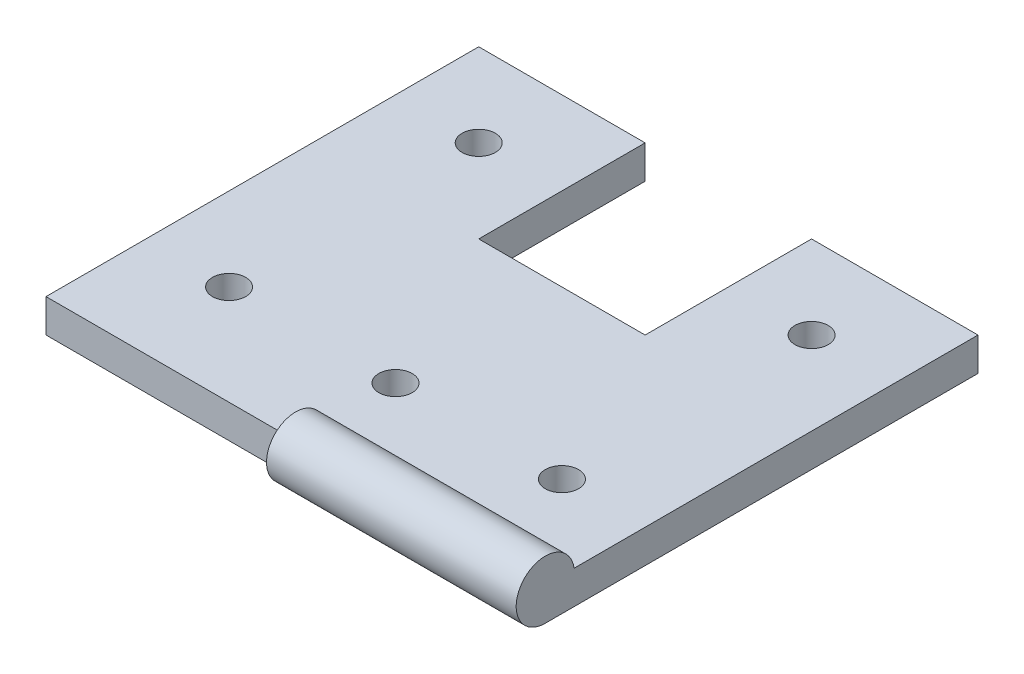
ISO-10303-21;
HEADER;
FILE_DESCRIPTION(('STEP AP214'),'2;1');
FILE_NAME('part.step','',(''),(''),'','','');
FILE_SCHEMA(('AUTOMOTIVE_DESIGN { 1 0 10303 214 1 1 1 1 }'));
ENDSEC;
DATA;
#1=APPLICATION_CONTEXT('core data for automotive mechanical design processes');
#2=APPLICATION_PROTOCOL_DEFINITION('international standard','automotive_design',2000,#1);
#3=PRODUCT_CONTEXT('',#1,'mechanical');
#4=PRODUCT('Part','Part','',(#3));
#5=PRODUCT_RELATED_PRODUCT_CATEGORY('part','',(#4));
#6=PRODUCT_DEFINITION_FORMATION('','',#4);
#7=PRODUCT_DEFINITION_CONTEXT('part definition',#1,'design');
#8=PRODUCT_DEFINITION('design','',#6,#7);
#9=PRODUCT_DEFINITION_SHAPE('','',#8);
#10=(LENGTH_UNIT() NAMED_UNIT(*) SI_UNIT(.MILLI.,.METRE.));
#11=(NAMED_UNIT(*) PLANE_ANGLE_UNIT() SI_UNIT($,.RADIAN.));
#12=(NAMED_UNIT(*) SI_UNIT($,.STERADIAN.) SOLID_ANGLE_UNIT());
#13=UNCERTAINTY_MEASURE_WITH_UNIT(LENGTH_MEASURE(1.E-05),#10,'distance_accuracy_value','');
#14=(GEOMETRIC_REPRESENTATION_CONTEXT(3) GLOBAL_UNCERTAINTY_ASSIGNED_CONTEXT((#13)) GLOBAL_UNIT_ASSIGNED_CONTEXT((#10,
#11,#12)) REPRESENTATION_CONTEXT('',''));
#15=CARTESIAN_POINT('',(0.,0.,0.));
#16=DIRECTION('',(0.,0.,1.));
#17=DIRECTION('',(1.,0.,0.));
#18=AXIS2_PLACEMENT_3D('',#15,#16,#17);
#19=CARTESIAN_POINT('',(18.0696318410112,1.,160.043414439873));
#20=DIRECTION('',(0.,0.,1.));
#21=DIRECTION('',(1.,0.,0.));
#22=AXIS2_PLACEMENT_3D('',#19,#20,#21);
#23=PLANE('',#22);
#24=DIRECTION('',(-1.,0.,0.));
#25=VECTOR('',#24,1.);
#26=CARTESIAN_POINT('',(18.0696318410112,1.,160.043414439873));
#27=LINE('',#26,#25);
#28=CARTESIAN_POINT('',(8.06963184101119,0.999999999999999,160.043414439873));
#29=VERTEX_POINT('',#28);
#30=CARTESIAN_POINT('',(3.06963184101119,1.,160.043414439873));
#31=VERTEX_POINT('',#30);
#32=EDGE_CURVE('E127',#29,#31,#27,.T.);
#33=ORIENTED_EDGE('',*,*,#32,.F.);
#34=DIRECTION('',(0.,-1.,0.));
#35=VECTOR('',#34,1.);
#36=CARTESIAN_POINT('',(8.06963184101119,10.,160.043414439873));
#37=LINE('',#36,#35);
#38=CARTESIAN_POINT('',(8.06963184101119,0.,160.043414439873));
#39=VERTEX_POINT('',#38);
#40=EDGE_CURVE('E111',#29,#39,#37,.T.);
#41=ORIENTED_EDGE('',*,*,#40,.T.);
#42=DIRECTION('',(-1.,0.,0.));
#43=VECTOR('',#42,1.);
#44=CARTESIAN_POINT('',(18.0696318410112,0.,160.043414439873));
#45=LINE('',#44,#43);
#46=CARTESIAN_POINT('',(3.06963184101119,0.,160.043414439873));
#47=VERTEX_POINT('',#46);
#48=EDGE_CURVE('E125',#39,#47,#45,.T.);
#49=ORIENTED_EDGE('',*,*,#48,.T.);
#50=DIRECTION('',(0.,-1.,0.));
#51=VECTOR('',#50,1.);
#52=CARTESIAN_POINT('',(3.06963184101119,1.,160.043414439873));
#53=LINE('',#52,#51);
#54=EDGE_CURVE('E41',#31,#47,#53,.T.);
#55=ORIENTED_EDGE('',*,*,#54,.F.);
#56=EDGE_LOOP('',(#33,#41,#49,#55));
#57=FACE_BOUND('',#56,.T.);
#58=ADVANCED_FACE('F33',(#57),#23,.F.);
#59=CARTESIAN_POINT('',(18.0696318410112,1.,173.043414439873));
#60=DIRECTION('',(0.,0.,-1.));
#61=DIRECTION('',(-1.,0.,0.));
#62=AXIS2_PLACEMENT_3D('',#59,#60,#61);
#63=PLANE('',#62);
#64=DIRECTION('',(0.,-1.,0.));
#65=VECTOR('',#64,1.);
#66=CARTESIAN_POINT('',(10.5696318410112,1.,173.043414439873));
#67=LINE('',#66,#65);
#68=CARTESIAN_POINT('',(10.5696318410112,1.,173.043414439873));
#69=VERTEX_POINT('',#68);
#70=CARTESIAN_POINT('',(10.5696318410112,0.,173.043414439873));
#71=VERTEX_POINT('',#70);
#72=EDGE_CURVE('E165',#69,#71,#67,.T.);
#73=ORIENTED_EDGE('',*,*,#72,.F.);
#74=DIRECTION('',(1.,0.,0.));
#75=VECTOR('',#74,1.);
#76=CARTESIAN_POINT('',(18.0696318410112,1.,173.043414439873));
#77=LINE('',#76,#75);
#78=CARTESIAN_POINT('',(3.06963184101119,1.,173.043414439873));
#79=VERTEX_POINT('',#78);
#80=EDGE_CURVE('E151',#79,#69,#77,.T.);
#81=ORIENTED_EDGE('',*,*,#80,.F.);
#82=DIRECTION('',(0.,-1.,0.));
#83=VECTOR('',#82,1.);
#84=CARTESIAN_POINT('',(3.06963184101119,1.,173.043414439873));
#85=LINE('',#84,#83);
#86=CARTESIAN_POINT('',(3.06963184101119,0.,173.043414439873));
#87=VERTEX_POINT('',#86);
#88=EDGE_CURVE('E149',#79,#87,#85,.T.);
#89=ORIENTED_EDGE('',*,*,#88,.T.);
#90=DIRECTION('',(1.,0.,0.));
#91=VECTOR('',#90,1.);
#92=CARTESIAN_POINT('',(18.0696318410112,0.,173.043414439873));
#93=LINE('',#92,#91);
#94=EDGE_CURVE('E145',#87,#71,#93,.T.);
#95=ORIENTED_EDGE('',*,*,#94,.T.);
#96=EDGE_LOOP('',(#73,#81,#89,#95));
#97=FACE_BOUND('',#96,.T.);
#98=ADVANCED_FACE('F253',(#97),#63,.F.);
#99=CARTESIAN_POINT('',(18.0696318410112,1.,160.043414439873));
#100=DIRECTION('',(-1.,0.,0.));
#101=DIRECTION('',(0.,0.,1.));
#102=AXIS2_PLACEMENT_3D('',#99,#100,#101);
#103=PLANE('',#102);
#104=DIRECTION('',(0.,0.,-1.));
#105=VECTOR('',#104,1.);
#106=CARTESIAN_POINT('',(18.0696318410112,1.,160.043414439873));
#107=LINE('',#106,#105);
#108=CARTESIAN_POINT('',(18.0696318410112,1.,172.177389036088));
#109=VERTEX_POINT('',#108);
#110=CARTESIAN_POINT('',(18.0696318410112,1.,160.043414439873));
#111=VERTEX_POINT('',#110);
#112=EDGE_CURVE('E148',#109,#111,#107,.T.);
#113=ORIENTED_EDGE('',*,*,#112,.F.);
#114=CARTESIAN_POINT('',(18.0696318410112,0.875,173.043414439873));
#115=DIRECTION('',(1.,0.,0.));
#116=DIRECTION('',(0.,0.,-1.));
#117=AXIS2_PLACEMENT_3D('',#114,#115,#116);
#118=CIRCLE('',#117,0.874999999999991);
#119=CARTESIAN_POINT('',(18.0696318410112,0.,173.043414439873));
#120=VERTEX_POINT('',#119);
#121=EDGE_CURVE('E170',#109,#120,#118,.T.);
#122=ORIENTED_EDGE('',*,*,#121,.T.);
#123=DIRECTION('',(0.,0.,-1.));
#124=VECTOR('',#123,1.);
#125=CARTESIAN_POINT('',(18.0696318410112,0.,160.043414439873));
#126=LINE('',#125,#124);
#127=CARTESIAN_POINT('',(18.0696318410112,0.,160.043414439873));
#128=VERTEX_POINT('',#127);
#129=EDGE_CURVE('E135',#120,#128,#126,.T.);
#130=ORIENTED_EDGE('',*,*,#129,.T.);
#131=DIRECTION('',(0.,-1.,0.));
#132=VECTOR('',#131,1.);
#133=CARTESIAN_POINT('',(18.0696318410112,1.,160.043414439873));
#134=LINE('',#133,#132);
#135=EDGE_CURVE('E11',#111,#128,#134,.T.);
#136=ORIENTED_EDGE('',*,*,#135,.F.);
#137=EDGE_LOOP('',(#113,#122,#130,#136));
#138=FACE_BOUND('',#137,.T.);
#139=ADVANCED_FACE('F35',(#138),#103,.F.);
#140=CARTESIAN_POINT('',(13.0696318410112,0.,160.043414439873));
#141=VERTEX_POINT('',#140);
#142=EDGE_CURVE('E134',#128,#141,#45,.T.);
#143=ORIENTED_EDGE('',*,*,#142,.T.);
#144=DIRECTION('',(0.,-1.,0.));
#145=VECTOR('',#144,1.);
#146=CARTESIAN_POINT('',(13.0696318410112,10.,160.043414439873));
#147=LINE('',#146,#145);
#148=CARTESIAN_POINT('',(13.0696318410112,0.999999999999999,160.043414439873));
#149=VERTEX_POINT('',#148);
#150=EDGE_CURVE('E48',#149,#141,#147,.T.);
#151=ORIENTED_EDGE('',*,*,#150,.F.);
#152=EDGE_CURVE('E158',#111,#149,#27,.T.);
#153=ORIENTED_EDGE('',*,*,#152,.F.);
#154=ORIENTED_EDGE('',*,*,#135,.T.);
#155=EDGE_LOOP('',(#143,#151,#153,#154));
#156=FACE_BOUND('',#155,.T.);
#157=ADVANCED_FACE('F240',(#156),#23,.F.);
#158=CARTESIAN_POINT('',(3.06963184101119,1.,160.043414439873));
#159=DIRECTION('',(1.,0.,0.));
#160=DIRECTION('',(0.,0.,-1.));
#161=AXIS2_PLACEMENT_3D('',#158,#159,#160);
#162=PLANE('',#161);
#163=DIRECTION('',(0.,0.,1.));
#164=VECTOR('',#163,1.);
#165=CARTESIAN_POINT('',(3.06963184101119,0.,160.043414439873));
#166=LINE('',#165,#164);
#167=EDGE_CURVE('E133',#47,#87,#166,.T.);
#168=ORIENTED_EDGE('',*,*,#167,.T.);
#169=ORIENTED_EDGE('',*,*,#88,.F.);
#170=DIRECTION('',(0.,0.,1.));
#171=VECTOR('',#170,1.);
#172=CARTESIAN_POINT('',(3.06963184101119,1.,160.043414439873));
#173=LINE('',#172,#171);
#174=EDGE_CURVE('E156',#31,#79,#173,.T.);
#175=ORIENTED_EDGE('',*,*,#174,.F.);
#176=ORIENTED_EDGE('',*,*,#54,.T.);
#177=EDGE_LOOP('',(#168,#169,#175,#176));
#178=FACE_BOUND('',#177,.T.);
#179=ADVANCED_FACE('F154',(#178),#162,.F.);
#180=CARTESIAN_POINT('',(0.,1.,0.));
#181=DIRECTION('',(0.,-1.,0.));
#182=DIRECTION('',(0.,0.,-1.));
#183=AXIS2_PLACEMENT_3D('',#180,#181,#182);
#184=PLANE('',#183);
#185=CARTESIAN_POINT('',(5.56963184101119,1.,162.543414439873));
#186=DIRECTION('',(0.,1.,0.));
#187=DIRECTION('',(0.,0.,1.));
#188=AXIS2_PLACEMENT_3D('',#185,#186,#187);
#189=CIRCLE('',#188,0.500000000000001);
#190=CARTESIAN_POINT('',(5.56963184101119,1.,163.043414439873));
#191=VERTEX_POINT('',#190);
#192=EDGE_CURVE('E195',#191,#191,#189,.T.);
#193=ORIENTED_EDGE('',*,*,#192,.F.);
#194=EDGE_LOOP('',(#193));
#195=FACE_BOUND('',#194,.T.);
#196=CARTESIAN_POINT('',(5.56963184101119,1.,170.043414439873));
#197=DIRECTION('',(0.,1.,0.));
#198=DIRECTION('',(0.,0.,1.));
#199=AXIS2_PLACEMENT_3D('',#196,#197,#198);
#200=CIRCLE('',#199,0.500000000000001);
#201=CARTESIAN_POINT('',(5.56963184101119,1.,170.543414439873));
#202=VERTEX_POINT('',#201);
#203=EDGE_CURVE('E201',#202,#202,#200,.T.);
#204=ORIENTED_EDGE('',*,*,#203,.F.);
#205=EDGE_LOOP('',(#204));
#206=FACE_BOUND('',#205,.T.);
#207=CARTESIAN_POINT('',(10.5696318410112,1.,170.043414439873));
#208=DIRECTION('',(0.,1.,0.));
#209=DIRECTION('',(0.,0.,1.));
#210=AXIS2_PLACEMENT_3D('',#207,#208,#209);
#211=CIRCLE('',#210,0.500000000000001);
#212=CARTESIAN_POINT('',(10.5696318410112,1.,170.543414439873));
#213=VERTEX_POINT('',#212);
#214=EDGE_CURVE('E207',#213,#213,#211,.T.);
#215=ORIENTED_EDGE('',*,*,#214,.F.);
#216=EDGE_LOOP('',(#215));
#217=FACE_BOUND('',#216,.T.);
#218=CARTESIAN_POINT('',(15.5696318410112,1.,170.043414439873));
#219=DIRECTION('',(0.,1.,0.));
#220=DIRECTION('',(0.,0.,1.));
#221=AXIS2_PLACEMENT_3D('',#218,#219,#220);
#222=CIRCLE('',#221,0.499999999999996);
#223=CARTESIAN_POINT('',(15.5696318410112,1.,170.543414439873));
#224=VERTEX_POINT('',#223);
#225=EDGE_CURVE('E213',#224,#224,#222,.T.);
#226=ORIENTED_EDGE('',*,*,#225,.F.);
#227=EDGE_LOOP('',(#226));
#228=FACE_BOUND('',#227,.T.);
#229=CARTESIAN_POINT('',(15.5696318410112,1.,162.543414439873));
#230=DIRECTION('',(0.,1.,0.));
#231=DIRECTION('',(0.,0.,1.));
#232=AXIS2_PLACEMENT_3D('',#229,#230,#231);
#233=CIRCLE('',#232,0.499999999999998);
#234=CARTESIAN_POINT('',(15.5696318410112,1.,163.043414439873));
#235=VERTEX_POINT('',#234);
#236=EDGE_CURVE('E189',#235,#235,#233,.T.);
#237=ORIENTED_EDGE('',*,*,#236,.F.);
#238=EDGE_LOOP('',(#237));
#239=FACE_BOUND('',#238,.T.);
#240=DIRECTION('',(-1.,0.,0.));
#241=VECTOR('',#240,1.);
#242=CARTESIAN_POINT('',(0.,1.,165.043414439873));
#243=LINE('',#242,#241);
#244=CARTESIAN_POINT('',(13.0696318410112,0.999999999999999,165.043414439873));
#245=VERTEX_POINT('',#244);
#246=CARTESIAN_POINT('',(8.06963184101119,0.999999999999999,165.043414439873));
#247=VERTEX_POINT('',#246);
#248=EDGE_CURVE('E177',#245,#247,#243,.T.);
#249=ORIENTED_EDGE('',*,*,#248,.T.);
#250=DIRECTION('',(0.,0.,-1.));
#251=VECTOR('',#250,1.);
#252=CARTESIAN_POINT('',(8.0696318410113,1.,0.));
#253=LINE('',#252,#251);
#254=EDGE_CURVE('E173',#247,#29,#253,.T.);
#255=ORIENTED_EDGE('',*,*,#254,.T.);
#256=ORIENTED_EDGE('',*,*,#32,.T.);
#257=ORIENTED_EDGE('',*,*,#174,.T.);
#258=ORIENTED_EDGE('',*,*,#80,.T.);
#259=DIRECTION('',(0.,0.,1.));
#260=VECTOR('',#259,1.);
#261=CARTESIAN_POINT('',(10.5696318410112,1.,0.));
#262=LINE('',#261,#260);
#263=CARTESIAN_POINT('',(10.5696318410112,1.,172.177389036088));
#264=VERTEX_POINT('',#263);
#265=EDGE_CURVE('E56',#264,#69,#262,.T.);
#266=ORIENTED_EDGE('',*,*,#265,.F.);
#267=DIRECTION('',(1.,0.,0.));
#268=VECTOR('',#267,1.);
#269=CARTESIAN_POINT('',(10.5696318410112,1.,172.177389036088));
#270=LINE('',#269,#268);
#271=EDGE_CURVE('E139',#264,#109,#270,.T.);
#272=ORIENTED_EDGE('',*,*,#271,.T.);
#273=ORIENTED_EDGE('',*,*,#112,.T.);
#274=ORIENTED_EDGE('',*,*,#152,.T.);
#275=DIRECTION('',(0.,0.,1.));
#276=VECTOR('',#275,1.);
#277=CARTESIAN_POINT('',(13.0696318410112,1.,0.));
#278=LINE('',#277,#276);
#279=EDGE_CURVE('E180',#149,#245,#278,.T.);
#280=ORIENTED_EDGE('',*,*,#279,.T.);
#281=EDGE_LOOP('',(#249,#255,#256,#257,#258,#266,#272,#273,#274,#280));
#282=FACE_BOUND('',#281,.T.);
#283=ADVANCED_FACE('F229',(#195,#206,#217,#228,#239,#282),#184,.F.);
#284=CARTESIAN_POINT('',(0.,0.,0.));
#285=DIRECTION('',(0.,-1.,0.));
#286=DIRECTION('',(0.,0.,-1.));
#287=AXIS2_PLACEMENT_3D('',#284,#285,#286);
#288=PLANE('',#287);
#289=CARTESIAN_POINT('',(5.56963184101119,0.,162.543414439873));
#290=DIRECTION('',(0.,1.,0.));
#291=DIRECTION('',(0.,0.,1.));
#292=AXIS2_PLACEMENT_3D('',#289,#290,#291);
#293=CIRCLE('',#292,0.500000000000001);
#294=CARTESIAN_POINT('',(5.56963184101119,0.,163.043414439873));
#295=VERTEX_POINT('',#294);
#296=EDGE_CURVE('E198',#295,#295,#293,.T.);
#297=ORIENTED_EDGE('',*,*,#296,.T.);
#298=EDGE_LOOP('',(#297));
#299=FACE_BOUND('',#298,.T.);
#300=CARTESIAN_POINT('',(5.56963184101119,0.,170.043414439873));
#301=DIRECTION('',(0.,1.,0.));
#302=DIRECTION('',(0.,0.,1.));
#303=AXIS2_PLACEMENT_3D('',#300,#301,#302);
#304=CIRCLE('',#303,0.500000000000001);
#305=CARTESIAN_POINT('',(5.56963184101119,0.,170.543414439873));
#306=VERTEX_POINT('',#305);
#307=EDGE_CURVE('E204',#306,#306,#304,.T.);
#308=ORIENTED_EDGE('',*,*,#307,.T.);
#309=EDGE_LOOP('',(#308));
#310=FACE_BOUND('',#309,.T.);
#311=CARTESIAN_POINT('',(10.5696318410112,0.,170.043414439873));
#312=DIRECTION('',(0.,1.,0.));
#313=DIRECTION('',(0.,0.,1.));
#314=AXIS2_PLACEMENT_3D('',#311,#312,#313);
#315=CIRCLE('',#314,0.500000000000001);
#316=CARTESIAN_POINT('',(10.5696318410112,0.,170.543414439873));
#317=VERTEX_POINT('',#316);
#318=EDGE_CURVE('E210',#317,#317,#315,.T.);
#319=ORIENTED_EDGE('',*,*,#318,.T.);
#320=EDGE_LOOP('',(#319));
#321=FACE_BOUND('',#320,.T.);
#322=CARTESIAN_POINT('',(15.5696318410112,0.,170.043414439873));
#323=DIRECTION('',(0.,1.,0.));
#324=DIRECTION('',(0.,0.,1.));
#325=AXIS2_PLACEMENT_3D('',#322,#323,#324);
#326=CIRCLE('',#325,0.499999999999996);
#327=CARTESIAN_POINT('',(15.5696318410112,0.,170.543414439873));
#328=VERTEX_POINT('',#327);
#329=EDGE_CURVE('E192',#328,#328,#326,.T.);
#330=ORIENTED_EDGE('',*,*,#329,.T.);
#331=EDGE_LOOP('',(#330));
#332=FACE_BOUND('',#331,.T.);
#333=CARTESIAN_POINT('',(15.5696318410112,0.,162.543414439873));
#334=DIRECTION('',(0.,1.,0.));
#335=DIRECTION('',(0.,0.,1.));
#336=AXIS2_PLACEMENT_3D('',#333,#334,#335);
#337=CIRCLE('',#336,0.499999999999998);
#338=CARTESIAN_POINT('',(15.5696318410112,0.,163.043414439873));
#339=VERTEX_POINT('',#338);
#340=EDGE_CURVE('E120',#339,#339,#337,.T.);
#341=ORIENTED_EDGE('',*,*,#340,.T.);
#342=EDGE_LOOP('',(#341));
#343=FACE_BOUND('',#342,.T.);
#344=DIRECTION('',(0.,0.,-1.));
#345=VECTOR('',#344,1.);
#346=CARTESIAN_POINT('',(8.06963184101119,0.,160.043414439873));
#347=LINE('',#346,#345);
#348=CARTESIAN_POINT('',(8.06963184101119,0.,165.043414439873));
#349=VERTEX_POINT('',#348);
#350=EDGE_CURVE('E108',#349,#39,#347,.T.);
#351=ORIENTED_EDGE('',*,*,#350,.F.);
#352=DIRECTION('',(-1.,0.,0.));
#353=VECTOR('',#352,1.);
#354=CARTESIAN_POINT('',(8.06963184101119,0.,165.043414439873));
#355=LINE('',#354,#353);
#356=CARTESIAN_POINT('',(13.0696318410112,0.,165.043414439873));
#357=VERTEX_POINT('',#356);
#358=EDGE_CURVE('E128',#357,#349,#355,.T.);
#359=ORIENTED_EDGE('',*,*,#358,.F.);
#360=DIRECTION('',(0.,0.,1.));
#361=VECTOR('',#360,1.);
#362=CARTESIAN_POINT('',(13.0696318410112,0.,160.043414439873));
#363=LINE('',#362,#361);
#364=EDGE_CURVE('E119',#141,#357,#363,.T.);
#365=ORIENTED_EDGE('',*,*,#364,.F.);
#366=ORIENTED_EDGE('',*,*,#142,.F.);
#367=ORIENTED_EDGE('',*,*,#129,.F.);
#368=EDGE_CURVE('E144',#71,#120,#93,.T.);
#369=ORIENTED_EDGE('',*,*,#368,.F.);
#370=ORIENTED_EDGE('',*,*,#94,.F.);
#371=ORIENTED_EDGE('',*,*,#167,.F.);
#372=ORIENTED_EDGE('',*,*,#48,.F.);
#373=EDGE_LOOP('',(#351,#359,#365,#366,#367,#369,#370,#371,#372));
#374=FACE_BOUND('',#373,.T.);
#375=ADVANCED_FACE('F131',(#299,#310,#321,#332,#343,#374),#288,.T.);
#376=CARTESIAN_POINT('',(10.5696318410112,0.875,173.043414439873));
#377=DIRECTION('',(1.,0.,0.));
#378=DIRECTION('',(0.,0.,-1.));
#379=AXIS2_PLACEMENT_3D('',#376,#377,#378);
#380=CYLINDRICAL_SURFACE('',#379,0.874999999999991);
#381=ORIENTED_EDGE('',*,*,#271,.F.);
#382=CARTESIAN_POINT('',(10.5696318410112,0.875,173.043414439873));
#383=DIRECTION('',(1.,0.,0.));
#384=DIRECTION('',(0.,0.,-1.));
#385=AXIS2_PLACEMENT_3D('',#382,#383,#384);
#386=CIRCLE('',#385,0.874999999999991);
#387=EDGE_CURVE('E169',#264,#71,#386,.T.);
#388=ORIENTED_EDGE('',*,*,#387,.T.);
#389=ORIENTED_EDGE('',*,*,#368,.T.);
#390=ORIENTED_EDGE('',*,*,#121,.F.);
#391=EDGE_LOOP('',(#381,#388,#389,#390));
#392=FACE_BOUND('',#391,.T.);
#393=ADVANCED_FACE('F248',(#392),#380,.T.);
#394=CARTESIAN_POINT('',(10.5696318410112,0.875,173.043414439873));
#395=DIRECTION('',(1.,0.,0.));
#396=DIRECTION('',(0.,0.,-1.));
#397=AXIS2_PLACEMENT_3D('',#394,#395,#396);
#398=PLANE('',#397);
#399=ORIENTED_EDGE('',*,*,#265,.T.);
#400=ORIENTED_EDGE('',*,*,#72,.T.);
#401=ORIENTED_EDGE('',*,*,#387,.F.);
#402=EDGE_LOOP('',(#399,#400,#401));
#403=FACE_BOUND('',#402,.T.);
#404=ADVANCED_FACE('F251',(#403),#398,.F.);
#405=CARTESIAN_POINT('',(8.06963184101119,10.,160.043414439873));
#406=DIRECTION('',(-1.,0.,0.));
#407=DIRECTION('',(0.,0.,1.));
#408=AXIS2_PLACEMENT_3D('',#405,#406,#407);
#409=PLANE('',#408);
#410=DIRECTION('',(0.,-1.,0.));
#411=VECTOR('',#410,1.);
#412=CARTESIAN_POINT('',(8.06963184101119,10.,165.043414439873));
#413=LINE('',#412,#411);
#414=EDGE_CURVE('E114',#247,#349,#413,.T.);
#415=ORIENTED_EDGE('',*,*,#414,.T.);
#416=ORIENTED_EDGE('',*,*,#350,.T.);
#417=ORIENTED_EDGE('',*,*,#40,.F.);
#418=ORIENTED_EDGE('',*,*,#254,.F.);
#419=EDGE_LOOP('',(#415,#416,#417,#418));
#420=FACE_BOUND('',#419,.T.);
#421=ADVANCED_FACE('F110',(#420),#409,.F.);
#422=CARTESIAN_POINT('',(8.06963184101119,10.,165.043414439873));
#423=DIRECTION('',(0.,0.,1.));
#424=DIRECTION('',(1.,0.,0.));
#425=AXIS2_PLACEMENT_3D('',#422,#423,#424);
#426=PLANE('',#425);
#427=DIRECTION('',(0.,-1.,0.));
#428=VECTOR('',#427,1.);
#429=CARTESIAN_POINT('',(13.0696318410112,10.,165.043414439873));
#430=LINE('',#429,#428);
#431=EDGE_CURVE('E184',#245,#357,#430,.T.);
#432=ORIENTED_EDGE('',*,*,#431,.T.);
#433=ORIENTED_EDGE('',*,*,#358,.T.);
#434=ORIENTED_EDGE('',*,*,#414,.F.);
#435=ORIENTED_EDGE('',*,*,#248,.F.);
#436=EDGE_LOOP('',(#432,#433,#434,#435));
#437=FACE_BOUND('',#436,.T.);
#438=ADVANCED_FACE('F237',(#437),#426,.F.);
#439=CARTESIAN_POINT('',(13.0696318410112,10.,160.043414439873));
#440=DIRECTION('',(1.,0.,0.));
#441=DIRECTION('',(0.,0.,-1.));
#442=AXIS2_PLACEMENT_3D('',#439,#440,#441);
#443=PLANE('',#442);
#444=ORIENTED_EDGE('',*,*,#150,.T.);
#445=ORIENTED_EDGE('',*,*,#364,.T.);
#446=ORIENTED_EDGE('',*,*,#431,.F.);
#447=ORIENTED_EDGE('',*,*,#279,.F.);
#448=EDGE_LOOP('',(#444,#445,#446,#447));
#449=FACE_BOUND('',#448,.T.);
#450=ADVANCED_FACE('F238',(#449),#443,.F.);
#451=CARTESIAN_POINT('',(15.5696318410112,0.,162.543414439873));
#452=DIRECTION('',(0.,1.,0.));
#453=DIRECTION('',(0.,0.,1.));
#454=AXIS2_PLACEMENT_3D('',#451,#452,#453);
#455=CYLINDRICAL_SURFACE('',#454,0.499999999999998);
#456=ORIENTED_EDGE('',*,*,#340,.F.);
#457=EDGE_LOOP('',(#456));
#458=FACE_BOUND('',#457,.T.);
#459=ORIENTED_EDGE('',*,*,#236,.T.);
#460=EDGE_LOOP('',(#459));
#461=FACE_BOUND('',#460,.T.);
#462=ADVANCED_FACE('F225',(#458,#461),#455,.F.);
#463=CARTESIAN_POINT('',(15.5696318410112,0.,170.043414439873));
#464=DIRECTION('',(0.,1.,0.));
#465=DIRECTION('',(0.,0.,1.));
#466=AXIS2_PLACEMENT_3D('',#463,#464,#465);
#467=CYLINDRICAL_SURFACE('',#466,0.499999999999996);
#468=ORIENTED_EDGE('',*,*,#329,.F.);
#469=EDGE_LOOP('',(#468));
#470=FACE_BOUND('',#469,.T.);
#471=ORIENTED_EDGE('',*,*,#225,.T.);
#472=EDGE_LOOP('',(#471));
#473=FACE_BOUND('',#472,.T.);
#474=ADVANCED_FACE('F221',(#470,#473),#467,.F.);
#475=CARTESIAN_POINT('',(10.5696318410112,0.,170.043414439873));
#476=DIRECTION('',(0.,1.,0.));
#477=DIRECTION('',(0.,0.,1.));
#478=AXIS2_PLACEMENT_3D('',#475,#476,#477);
#479=CYLINDRICAL_SURFACE('',#478,0.500000000000001);
#480=ORIENTED_EDGE('',*,*,#318,.F.);
#481=EDGE_LOOP('',(#480));
#482=FACE_BOUND('',#481,.T.);
#483=ORIENTED_EDGE('',*,*,#214,.T.);
#484=EDGE_LOOP('',(#483));
#485=FACE_BOUND('',#484,.T.);
#486=ADVANCED_FACE('F224',(#482,#485),#479,.F.);
#487=CARTESIAN_POINT('',(5.56963184101119,0.,170.043414439873));
#488=DIRECTION('',(0.,1.,0.));
#489=DIRECTION('',(0.,0.,1.));
#490=AXIS2_PLACEMENT_3D('',#487,#488,#489);
#491=CYLINDRICAL_SURFACE('',#490,0.500000000000001);
#492=ORIENTED_EDGE('',*,*,#307,.F.);
#493=EDGE_LOOP('',(#492));
#494=FACE_BOUND('',#493,.T.);
#495=ORIENTED_EDGE('',*,*,#203,.T.);
#496=EDGE_LOOP('',(#495));
#497=FACE_BOUND('',#496,.T.);
#498=ADVANCED_FACE('F330',(#494,#497),#491,.F.);
#499=CARTESIAN_POINT('',(5.56963184101119,0.,162.543414439873));
#500=DIRECTION('',(0.,1.,0.));
#501=DIRECTION('',(0.,0.,1.));
#502=AXIS2_PLACEMENT_3D('',#499,#500,#501);
#503=CYLINDRICAL_SURFACE('',#502,0.500000000000001);
#504=ORIENTED_EDGE('',*,*,#296,.F.);
#505=EDGE_LOOP('',(#504));
#506=FACE_BOUND('',#505,.T.);
#507=ORIENTED_EDGE('',*,*,#192,.T.);
#508=EDGE_LOOP('',(#507));
#509=FACE_BOUND('',#508,.T.);
#510=ADVANCED_FACE('F338',(#506,#509),#503,.F.);
#511=CLOSED_SHELL('',(#58,#98,#139,#157,#179,#283,#375,#393,#404,#421,#438,#450,#462,#474,#486,
#498,#510));
#512=MANIFOLD_SOLID_BREP('B2',#511);
#513=ADVANCED_BREP_SHAPE_REPRESENTATION('',(#18,#512),#14);
#514=SHAPE_DEFINITION_REPRESENTATION(#9,#513);
ENDSEC;
END-ISO-10303-21;
